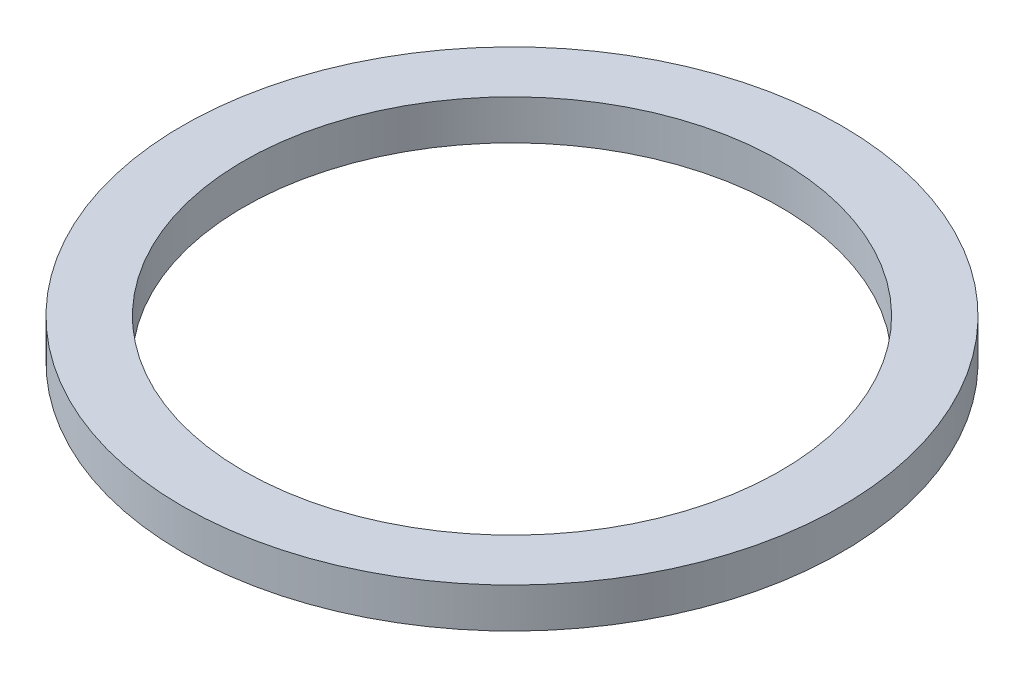
ISO-10303-21;
HEADER;
FILE_DESCRIPTION(('STEP AP214'),'2;1');
FILE_NAME('part.step','',(''),(''),'','','');
FILE_SCHEMA(('AUTOMOTIVE_DESIGN { 1 0 10303 214 1 1 1 1 }'));
ENDSEC;
DATA;
#1=APPLICATION_CONTEXT('core data for automotive mechanical design processes');
#2=APPLICATION_PROTOCOL_DEFINITION('international standard','automotive_design',2000,#1);
#3=PRODUCT_CONTEXT('',#1,'mechanical');
#4=PRODUCT('Part','Part','',(#3));
#5=PRODUCT_RELATED_PRODUCT_CATEGORY('part','',(#4));
#6=PRODUCT_DEFINITION_FORMATION('','',#4);
#7=PRODUCT_DEFINITION_CONTEXT('part definition',#1,'design');
#8=PRODUCT_DEFINITION('design','',#6,#7);
#9=PRODUCT_DEFINITION_SHAPE('','',#8);
#10=(LENGTH_UNIT() NAMED_UNIT(*) SI_UNIT(.MILLI.,.METRE.));
#11=(NAMED_UNIT(*) PLANE_ANGLE_UNIT() SI_UNIT($,.RADIAN.));
#12=(NAMED_UNIT(*) SI_UNIT($,.STERADIAN.) SOLID_ANGLE_UNIT());
#13=UNCERTAINTY_MEASURE_WITH_UNIT(LENGTH_MEASURE(1.E-05),#10,'distance_accuracy_value','');
#14=(GEOMETRIC_REPRESENTATION_CONTEXT(3) GLOBAL_UNCERTAINTY_ASSIGNED_CONTEXT((#13)) GLOBAL_UNIT_ASSIGNED_CONTEXT((#10,
#11,#12)) REPRESENTATION_CONTEXT('',''));
#15=CARTESIAN_POINT('',(0.,0.,0.));
#16=DIRECTION('',(0.,0.,1.));
#17=DIRECTION('',(1.,0.,0.));
#18=AXIS2_PLACEMENT_3D('',#15,#16,#17);
#19=CARTESIAN_POINT('',(0.,9.525,0.));
#20=DIRECTION('',(0.,1.,0.));
#21=DIRECTION('',(0.,0.,1.));
#22=AXIS2_PLACEMENT_3D('',#19,#20,#21);
#23=PLANE('',#22);
#24=CARTESIAN_POINT('',(0.,9.525,0.));
#25=DIRECTION('',(0.,1.,0.));
#26=DIRECTION('',(0.,0.,1.));
#27=AXIS2_PLACEMENT_3D('',#24,#25,#26);
#28=CIRCLE('',#27,78.74);
#29=CARTESIAN_POINT('',(0.,9.525,78.74));
#30=VERTEX_POINT('',#29);
#31=EDGE_CURVE('E10',#30,#30,#28,.T.);
#32=ORIENTED_EDGE('',*,*,#31,.T.);
#33=EDGE_LOOP('',(#32));
#34=FACE_BOUND('',#33,.T.);
#35=CARTESIAN_POINT('',(0.,9.525,0.));
#36=DIRECTION('',(0.,1.,0.));
#37=DIRECTION('',(0.,0.,1.));
#38=AXIS2_PLACEMENT_3D('',#35,#36,#37);
#39=CIRCLE('',#38,64.135);
#40=CARTESIAN_POINT('',(0.,9.525,64.135));
#41=VERTEX_POINT('',#40);
#42=EDGE_CURVE('E50',#41,#41,#39,.T.);
#43=ORIENTED_EDGE('',*,*,#42,.F.);
#44=EDGE_LOOP('',(#43));
#45=FACE_BOUND('',#44,.T.);
#46=ADVANCED_FACE('F37',(#34,#45),#23,.T.);
#47=CARTESIAN_POINT('',(0.,0.,0.));
#48=DIRECTION('',(0.,1.,0.));
#49=DIRECTION('',(0.,0.,1.));
#50=AXIS2_PLACEMENT_3D('',#47,#48,#49);
#51=PLANE('',#50);
#52=CARTESIAN_POINT('',(0.,0.,0.));
#53=DIRECTION('',(0.,1.,0.));
#54=DIRECTION('',(0.,0.,1.));
#55=AXIS2_PLACEMENT_3D('',#52,#53,#54);
#56=CIRCLE('',#55,78.74);
#57=CARTESIAN_POINT('',(0.,0.,78.74));
#58=VERTEX_POINT('',#57);
#59=EDGE_CURVE('E41',#58,#58,#56,.T.);
#60=ORIENTED_EDGE('',*,*,#59,.F.);
#61=EDGE_LOOP('',(#60));
#62=FACE_BOUND('',#61,.T.);
#63=CARTESIAN_POINT('',(0.,0.,0.));
#64=DIRECTION('',(0.,1.,0.));
#65=DIRECTION('',(0.,0.,1.));
#66=AXIS2_PLACEMENT_3D('',#63,#64,#65);
#67=CIRCLE('',#66,64.135);
#68=CARTESIAN_POINT('',(0.,0.,64.135));
#69=VERTEX_POINT('',#68);
#70=EDGE_CURVE('E52',#69,#69,#67,.T.);
#71=ORIENTED_EDGE('',*,*,#70,.T.);
#72=EDGE_LOOP('',(#71));
#73=FACE_BOUND('',#72,.T.);
#74=ADVANCED_FACE('F64',(#62,#73),#51,.F.);
#75=CARTESIAN_POINT('',(0.,9.525,0.));
#76=DIRECTION('',(0.,-1.,0.));
#77=DIRECTION('',(0.,0.,-1.));
#78=AXIS2_PLACEMENT_3D('',#75,#76,#77);
#79=CYLINDRICAL_SURFACE('',#78,78.74);
#80=ORIENTED_EDGE('',*,*,#31,.F.);
#81=EDGE_LOOP('',(#80));
#82=FACE_BOUND('',#81,.T.);
#83=ORIENTED_EDGE('',*,*,#59,.T.);
#84=EDGE_LOOP('',(#83));
#85=FACE_BOUND('',#84,.T.);
#86=ADVANCED_FACE('F39',(#82,#85),#79,.T.);
#87=CARTESIAN_POINT('',(0.,9.525,0.));
#88=DIRECTION('',(0.,-1.,0.));
#89=DIRECTION('',(0.,0.,-1.));
#90=AXIS2_PLACEMENT_3D('',#87,#88,#89);
#91=CYLINDRICAL_SURFACE('',#90,64.135);
#92=ORIENTED_EDGE('',*,*,#42,.T.);
#93=EDGE_LOOP('',(#92));
#94=FACE_BOUND('',#93,.T.);
#95=ORIENTED_EDGE('',*,*,#70,.F.);
#96=EDGE_LOOP('',(#95));
#97=FACE_BOUND('',#96,.T.);
#98=ADVANCED_FACE('F60',(#94,#97),#91,.F.);
#99=CLOSED_SHELL('',(#46,#74,#86,#98));
#100=MANIFOLD_SOLID_BREP('B2',#99);
#101=ADVANCED_BREP_SHAPE_REPRESENTATION('',(#18,#100),#14);
#102=SHAPE_DEFINITION_REPRESENTATION(#9,#101);
ENDSEC;
END-ISO-10303-21;
